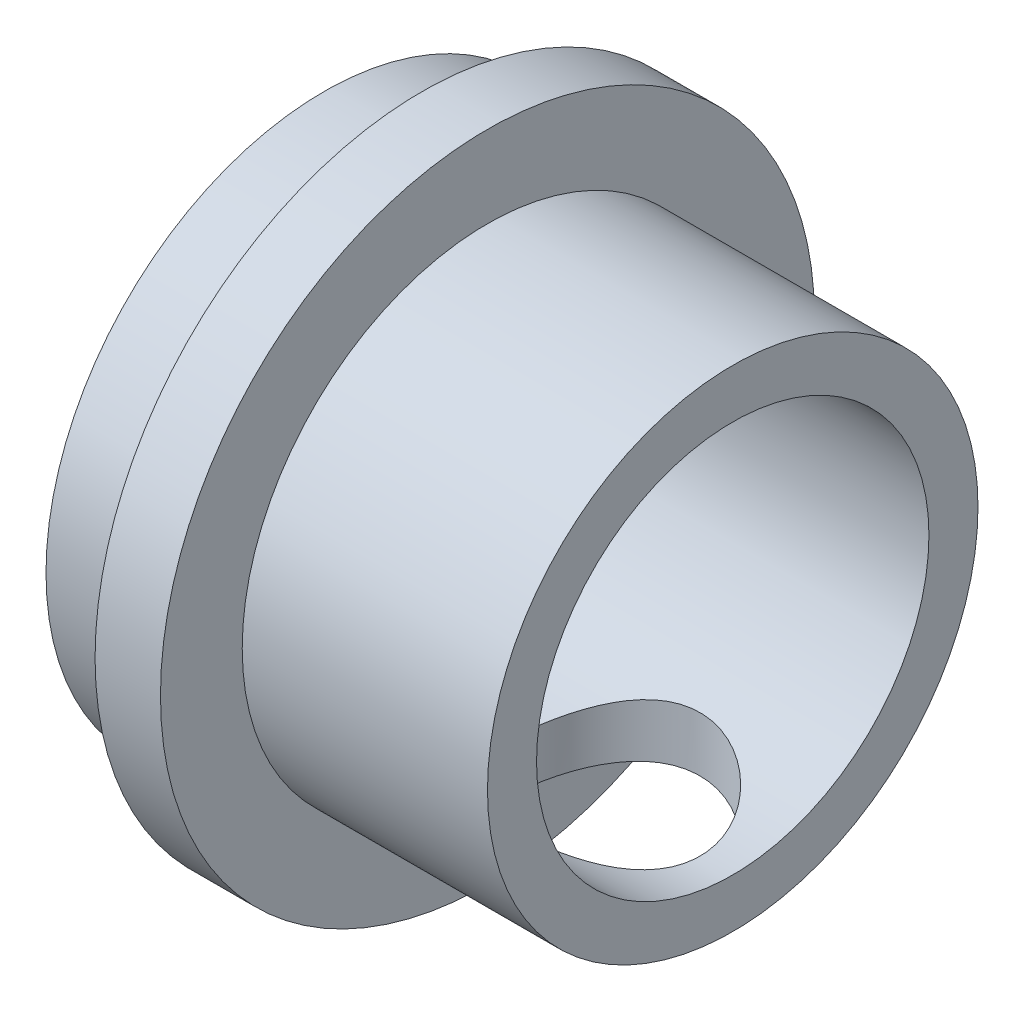
ISO-10303-21;
HEADER;
FILE_DESCRIPTION(('STEP AP214'),'2;1');
FILE_NAME('part.step','',(''),(''),'','','');
FILE_SCHEMA(('AUTOMOTIVE_DESIGN { 1 0 10303 214 1 1 1 1 }'));
ENDSEC;
DATA;
#1=APPLICATION_CONTEXT('core data for automotive mechanical design processes');
#2=APPLICATION_PROTOCOL_DEFINITION('international standard','automotive_design',2000,#1);
#3=PRODUCT_CONTEXT('',#1,'mechanical');
#4=PRODUCT('Part','Part','',(#3));
#5=PRODUCT_RELATED_PRODUCT_CATEGORY('part','',(#4));
#6=PRODUCT_DEFINITION_FORMATION('','',#4);
#7=PRODUCT_DEFINITION_CONTEXT('part definition',#1,'design');
#8=PRODUCT_DEFINITION('design','',#6,#7);
#9=PRODUCT_DEFINITION_SHAPE('','',#8);
#10=(LENGTH_UNIT() NAMED_UNIT(*) SI_UNIT(.MILLI.,.METRE.));
#11=(NAMED_UNIT(*) PLANE_ANGLE_UNIT() SI_UNIT($,.RADIAN.));
#12=(NAMED_UNIT(*) SI_UNIT($,.STERADIAN.) SOLID_ANGLE_UNIT());
#13=UNCERTAINTY_MEASURE_WITH_UNIT(LENGTH_MEASURE(1.E-05),#10,'distance_accuracy_value','');
#14=(GEOMETRIC_REPRESENTATION_CONTEXT(3) GLOBAL_UNCERTAINTY_ASSIGNED_CONTEXT((#13)) GLOBAL_UNIT_ASSIGNED_CONTEXT((#10,
#11,#12)) REPRESENTATION_CONTEXT('',''));
#15=CARTESIAN_POINT('',(0.,0.,0.));
#16=DIRECTION('',(0.,0.,1.));
#17=DIRECTION('',(1.,0.,0.));
#18=AXIS2_PLACEMENT_3D('',#15,#16,#17);
#19=CARTESIAN_POINT('',(12.5,4.,-4.));
#20=DIRECTION('',(0.,0.,-1.));
#21=DIRECTION('',(0.,1.,0.));
#22=AXIS2_PLACEMENT_3D('',#19,#20,#21);
#23=PLANE('',#22);
#24=DIRECTION('',(0.,-1.,0.));
#25=VECTOR('',#24,1.);
#26=CARTESIAN_POINT('',(2.5,4.,-4.));
#27=LINE('',#26,#25);
#28=CARTESIAN_POINT('',(2.5,4.,-4.));
#29=VERTEX_POINT('',#28);
#30=CARTESIAN_POINT('',(2.5,-4.,-4.));
#31=VERTEX_POINT('',#30);
#32=EDGE_CURVE('E54',#29,#31,#27,.T.);
#33=ORIENTED_EDGE('',*,*,#32,.F.);
#34=DIRECTION('',(-1.,0.,0.));
#35=VECTOR('',#34,1.);
#36=CARTESIAN_POINT('',(12.5,4.,-4.));
#37=LINE('',#36,#35);
#38=CARTESIAN_POINT('',(0.,4.,-4.));
#39=VERTEX_POINT('',#38);
#40=EDGE_CURVE('E97',#29,#39,#37,.T.);
#41=ORIENTED_EDGE('',*,*,#40,.T.);
#42=DIRECTION('',(0.,-1.,0.));
#43=VECTOR('',#42,1.);
#44=CARTESIAN_POINT('',(0.,4.,-4.));
#45=LINE('',#44,#43);
#46=CARTESIAN_POINT('',(0.,-4.,-4.));
#47=VERTEX_POINT('',#46);
#48=EDGE_CURVE('E198',#39,#47,#45,.T.);
#49=ORIENTED_EDGE('',*,*,#48,.T.);
#50=DIRECTION('',(-1.,0.,0.));
#51=VECTOR('',#50,1.);
#52=CARTESIAN_POINT('',(12.5,-4.,-4.));
#53=LINE('',#52,#51);
#54=EDGE_CURVE('E61',#31,#47,#53,.T.);
#55=ORIENTED_EDGE('',*,*,#54,.F.);
#56=EDGE_LOOP('',(#33,#41,#49,#55));
#57=FACE_BOUND('',#56,.T.);
#58=ADVANCED_FACE('F35',(#57),#23,.F.);
#59=CARTESIAN_POINT('',(12.5,4.,-4.));
#60=DIRECTION('',(0.,1.,0.));
#61=DIRECTION('',(0.,0.,1.));
#62=AXIS2_PLACEMENT_3D('',#59,#60,#61);
#63=PLANE('',#62);
#64=DIRECTION('',(0.,0.,-1.));
#65=VECTOR('',#64,1.);
#66=CARTESIAN_POINT('',(2.5,4.,-4.));
#67=LINE('',#66,#65);
#68=CARTESIAN_POINT('',(2.5,4.,4.));
#69=VERTEX_POINT('',#68);
#70=EDGE_CURVE('E89',#69,#29,#67,.T.);
#71=ORIENTED_EDGE('',*,*,#70,.F.);
#72=DIRECTION('',(-1.,0.,0.));
#73=VECTOR('',#72,1.);
#74=CARTESIAN_POINT('',(12.5,4.,4.));
#75=LINE('',#74,#73);
#76=CARTESIAN_POINT('',(0.,4.,4.));
#77=VERTEX_POINT('',#76);
#78=EDGE_CURVE('E88',#69,#77,#75,.T.);
#79=ORIENTED_EDGE('',*,*,#78,.T.);
#80=DIRECTION('',(0.,0.,-1.));
#81=VECTOR('',#80,1.);
#82=CARTESIAN_POINT('',(0.,4.,-4.));
#83=LINE('',#82,#81);
#84=EDGE_CURVE('E99',#77,#39,#83,.T.);
#85=ORIENTED_EDGE('',*,*,#84,.T.);
#86=ORIENTED_EDGE('',*,*,#40,.F.);
#87=EDGE_LOOP('',(#71,#79,#85,#86));
#88=FACE_BOUND('',#87,.T.);
#89=ADVANCED_FACE('F165',(#88),#63,.F.);
#90=CARTESIAN_POINT('',(12.5,4.,4.));
#91=DIRECTION('',(0.,0.,1.));
#92=DIRECTION('',(0.,-1.,0.));
#93=AXIS2_PLACEMENT_3D('',#90,#91,#92);
#94=PLANE('',#93);
#95=DIRECTION('',(0.,1.,0.));
#96=VECTOR('',#95,1.);
#97=CARTESIAN_POINT('',(2.5,4.,4.));
#98=LINE('',#97,#96);
#99=CARTESIAN_POINT('',(2.5,-4.,4.));
#100=VERTEX_POINT('',#99);
#101=EDGE_CURVE('E80',#100,#69,#98,.T.);
#102=ORIENTED_EDGE('',*,*,#101,.F.);
#103=DIRECTION('',(-1.,0.,0.));
#104=VECTOR('',#103,1.);
#105=CARTESIAN_POINT('',(12.5,-4.,4.));
#106=LINE('',#105,#104);
#107=CARTESIAN_POINT('',(0.,-4.,4.));
#108=VERTEX_POINT('',#107);
#109=EDGE_CURVE('E87',#100,#108,#106,.T.);
#110=ORIENTED_EDGE('',*,*,#109,.T.);
#111=DIRECTION('',(0.,1.,0.));
#112=VECTOR('',#111,1.);
#113=CARTESIAN_POINT('',(0.,4.,4.));
#114=LINE('',#113,#112);
#115=EDGE_CURVE('E201',#108,#77,#114,.T.);
#116=ORIENTED_EDGE('',*,*,#115,.T.);
#117=ORIENTED_EDGE('',*,*,#78,.F.);
#118=EDGE_LOOP('',(#102,#110,#116,#117));
#119=FACE_BOUND('',#118,.T.);
#120=ADVANCED_FACE('F85',(#119),#94,.F.);
#121=CARTESIAN_POINT('',(12.5,-4.,-4.));
#122=DIRECTION('',(0.,-1.,0.));
#123=DIRECTION('',(0.,0.,-1.));
#124=AXIS2_PLACEMENT_3D('',#121,#122,#123);
#125=PLANE('',#124);
#126=DIRECTION('',(0.,0.,1.));
#127=VECTOR('',#126,1.);
#128=CARTESIAN_POINT('',(2.5,-4.,-4.));
#129=LINE('',#128,#127);
#130=EDGE_CURVE('E11',#31,#100,#129,.T.);
#131=ORIENTED_EDGE('',*,*,#130,.F.);
#132=ORIENTED_EDGE('',*,*,#54,.T.);
#133=DIRECTION('',(0.,0.,1.));
#134=VECTOR('',#133,1.);
#135=CARTESIAN_POINT('',(0.,-4.,-4.));
#136=LINE('',#135,#134);
#137=EDGE_CURVE('E94',#47,#108,#136,.T.);
#138=ORIENTED_EDGE('',*,*,#137,.T.);
#139=ORIENTED_EDGE('',*,*,#109,.F.);
#140=EDGE_LOOP('',(#131,#132,#138,#139));
#141=FACE_BOUND('',#140,.T.);
#142=ADVANCED_FACE('F92',(#141),#125,.F.);
#143=CARTESIAN_POINT('',(0.,0.,0.));
#144=DIRECTION('',(1.,0.,0.));
#145=DIRECTION('',(0.,0.,-1.));
#146=AXIS2_PLACEMENT_3D('',#143,#144,#145);
#147=PLANE('',#146);
#148=ORIENTED_EDGE('',*,*,#137,.F.);
#149=ORIENTED_EDGE('',*,*,#48,.F.);
#150=ORIENTED_EDGE('',*,*,#84,.F.);
#151=ORIENTED_EDGE('',*,*,#115,.F.);
#152=EDGE_LOOP('',(#148,#149,#150,#151));
#153=FACE_BOUND('',#152,.T.);
#154=CARTESIAN_POINT('',(0.,0.,0.));
#155=DIRECTION('',(-1.,0.,0.));
#156=DIRECTION('',(0.,0.,1.));
#157=AXIS2_PLACEMENT_3D('',#154,#155,#156);
#158=CIRCLE('',#157,8.5);
#159=CARTESIAN_POINT('',(0.,0.,8.5));
#160=VERTEX_POINT('',#159);
#161=EDGE_CURVE('E48',#160,#160,#158,.T.);
#162=ORIENTED_EDGE('',*,*,#161,.T.);
#163=EDGE_LOOP('',(#162));
#164=FACE_BOUND('',#163,.T.);
#165=ADVANCED_FACE('F37',(#153,#164),#147,.F.);
#166=CARTESIAN_POINT('',(-59.6035396155649,0.,0.));
#167=DIRECTION('',(-1.,0.,0.));
#168=DIRECTION('',(0.,0.,1.));
#169=AXIS2_PLACEMENT_3D('',#166,#167,#168);
#170=CYLINDRICAL_SURFACE('',#169,8.5);
#171=ORIENTED_EDGE('',*,*,#161,.F.);
#172=EDGE_LOOP('',(#171));
#173=FACE_BOUND('',#172,.T.);
#174=CARTESIAN_POINT('',(3.,0.,0.));
#175=DIRECTION('',(-1.,0.,0.));
#176=DIRECTION('',(0.,0.,1.));
#177=AXIS2_PLACEMENT_3D('',#174,#175,#176);
#178=CIRCLE('',#177,8.5);
#179=CARTESIAN_POINT('',(3.,0.,8.5));
#180=VERTEX_POINT('',#179);
#181=EDGE_CURVE('E115',#180,#180,#178,.T.);
#182=ORIENTED_EDGE('',*,*,#181,.T.);
#183=EDGE_LOOP('',(#182));
#184=FACE_BOUND('',#183,.T.);
#185=ADVANCED_FACE('F122',(#173,#184),#170,.T.);
#186=CARTESIAN_POINT('',(3.,9.09366399233855,0.));
#187=DIRECTION('',(1.,0.,0.));
#188=DIRECTION('',(0.,0.,-1.));
#189=AXIS2_PLACEMENT_3D('',#186,#187,#188);
#190=PLANE('',#189);
#191=ORIENTED_EDGE('',*,*,#181,.F.);
#192=EDGE_LOOP('',(#191));
#193=FACE_BOUND('',#192,.T.);
#194=CARTESIAN_POINT('',(3.,0.,0.));
#195=DIRECTION('',(-1.,0.,0.));
#196=DIRECTION('',(0.,0.,1.));
#197=AXIS2_PLACEMENT_3D('',#194,#195,#196);
#198=CIRCLE('',#197,10.);
#199=CARTESIAN_POINT('',(3.,0.,10.));
#200=VERTEX_POINT('',#199);
#201=EDGE_CURVE('E112',#200,#200,#198,.T.);
#202=ORIENTED_EDGE('',*,*,#201,.T.);
#203=EDGE_LOOP('',(#202));
#204=FACE_BOUND('',#203,.T.);
#205=ADVANCED_FACE('F125',(#193,#204),#190,.F.);
#206=CARTESIAN_POINT('',(-59.6035396155649,0.,0.));
#207=DIRECTION('',(-1.,0.,0.));
#208=DIRECTION('',(0.,0.,1.));
#209=AXIS2_PLACEMENT_3D('',#206,#207,#208);
#210=CYLINDRICAL_SURFACE('',#209,10.);
#211=ORIENTED_EDGE('',*,*,#201,.F.);
#212=EDGE_LOOP('',(#211));
#213=FACE_BOUND('',#212,.T.);
#214=CARTESIAN_POINT('',(5.,0.,0.));
#215=DIRECTION('',(-1.,0.,0.));
#216=DIRECTION('',(0.,0.,1.));
#217=AXIS2_PLACEMENT_3D('',#214,#215,#216);
#218=CIRCLE('',#217,10.);
#219=CARTESIAN_POINT('',(5.,0.,10.));
#220=VERTEX_POINT('',#219);
#221=EDGE_CURVE('E109',#220,#220,#218,.T.);
#222=ORIENTED_EDGE('',*,*,#221,.T.);
#223=EDGE_LOOP('',(#222));
#224=FACE_BOUND('',#223,.T.);
#225=ADVANCED_FACE('F130',(#213,#224),#210,.T.);
#226=CARTESIAN_POINT('',(5.,10.,0.));
#227=DIRECTION('',(-1.,0.,0.));
#228=DIRECTION('',(0.,0.,1.));
#229=AXIS2_PLACEMENT_3D('',#226,#227,#228);
#230=PLANE('',#229);
#231=ORIENTED_EDGE('',*,*,#221,.F.);
#232=EDGE_LOOP('',(#231));
#233=FACE_BOUND('',#232,.T.);
#234=CARTESIAN_POINT('',(5.,0.,0.));
#235=DIRECTION('',(-1.,0.,0.));
#236=DIRECTION('',(0.,0.,1.));
#237=AXIS2_PLACEMENT_3D('',#234,#235,#236);
#238=CIRCLE('',#237,7.5);
#239=CARTESIAN_POINT('',(5.,0.,7.5));
#240=VERTEX_POINT('',#239);
#241=EDGE_CURVE('E106',#240,#240,#238,.T.);
#242=ORIENTED_EDGE('',*,*,#241,.T.);
#243=EDGE_LOOP('',(#242));
#244=FACE_BOUND('',#243,.T.);
#245=ADVANCED_FACE('F136',(#233,#244),#230,.F.);
#246=CARTESIAN_POINT('',(-59.6035396155649,0.,0.));
#247=DIRECTION('',(-1.,0.,0.));
#248=DIRECTION('',(0.,0.,1.));
#249=AXIS2_PLACEMENT_3D('',#246,#247,#248);
#250=CYLINDRICAL_SURFACE('',#249,7.5);
#251=CARTESIAN_POINT('',(8.5,-6.87386354243376,3.));
#252=CARTESIAN_POINT('',(8.66068553456943,-6.87387034169605,2.99999310102034));
#253=CARTESIAN_POINT('',(8.82163944149776,-6.87957650695683,2.9870126033011));
#254=CARTESIAN_POINT('',(9.13890862614936,-6.901666249599,2.93560066312235));
#255=CARTESIAN_POINT('',(9.29521098150777,-6.9180771094252,2.89710418548511));
#256=CARTESIAN_POINT('',(9.59807771345624,-6.95940616078833,2.79635331714323));
#257=CARTESIAN_POINT('',(9.74467636493683,-6.98429226391323,2.73418843497826));
#258=CARTESIAN_POINT('',(10.0253280322934,-7.0397201578331,2.58813019791228));
#259=CARTESIAN_POINT('',(10.1593837787862,-7.07026071330917,2.5042415873656));
#260=CARTESIAN_POINT('',(10.4188904718165,-7.13551292343503,2.31198302134881));
#261=CARTESIAN_POINT('',(10.5435345990959,-7.17035875533909,2.20256905254826));
#262=CARTESIAN_POINT('',(10.7732935312837,-7.23918686872916,1.96456364269823));
#263=CARTESIAN_POINT('',(10.8784015115646,-7.27316884487642,1.8359655281602));
#264=CARTESIAN_POINT('',(11.0701095854646,-7.33805111462092,1.55700947005954));
#265=CARTESIAN_POINT('',(11.1558164495289,-7.36877705418855,1.40599344962864));
#266=CARTESIAN_POINT('',(11.3002653552607,-7.42205891553774,1.09023798310296));
#267=CARTESIAN_POINT('',(11.3590183693733,-7.44461816104874,0.925504153615325));
#268=CARTESIAN_POINT('',(11.4450122289896,-7.47807487485913,0.595449640559631));
#269=CARTESIAN_POINT('',(11.4736409709553,-7.48948405155941,0.430543477287475));
#270=CARTESIAN_POINT('',(11.5030427286722,-7.50120466031146,0.0978994928759432));
#271=CARTESIAN_POINT('',(11.5038261339487,-7.50152023155834,-0.0698372487591169));
#272=CARTESIAN_POINT('',(11.4782758452937,-7.49132944230918,-0.393348742053133));
#273=CARTESIAN_POINT('',(11.4534628408679,-7.48142995157228,-0.549266179305685));
#274=CARTESIAN_POINT('',(11.3800106855455,-7.45273937203712,-0.85450966383287));
#275=CARTESIAN_POINT('',(11.3313697864023,-7.43394763082012,-1.00383522658686));
#276=CARTESIAN_POINT('',(11.2110452756826,-7.388952366862,-1.29434690776584));
#277=CARTESIAN_POINT('',(11.1390254277769,-7.36264140699335,-1.43537643506834));
#278=CARTESIAN_POINT('',(10.9743024896213,-7.30521877770412,-1.70371222611197));
#279=CARTESIAN_POINT('',(10.8815923103497,-7.27410546400724,-1.83101376407694));
#280=CARTESIAN_POINT('',(10.6710262960842,-7.20782455764183,-2.07715324198526));
#281=CARTESIAN_POINT('',(10.5519191611408,-7.17252489767638,-2.19488676789948));
#282=CARTESIAN_POINT('',(10.295514142252,-7.10342491459894,-2.40916112308897));
#283=CARTESIAN_POINT('',(10.1582103277066,-7.06962508512114,-2.50569501568047));
#284=CARTESIAN_POINT('',(9.86437146643909,-7.00645346113535,-2.67735628307891));
#285=CARTESIAN_POINT('',(9.70740275449202,-6.97723371086562,-2.75180197745439));
#286=CARTESIAN_POINT('',(9.38167676453166,-6.92831385516127,-2.87276438979969));
#287=CARTESIAN_POINT('',(9.21292722291011,-6.90860756836966,-2.91929924756697));
#288=CARTESIAN_POINT('',(8.87944633379884,-6.88244639554074,-2.98043242328234));
#289=CARTESIAN_POINT('',(8.71509932930716,-6.87525549684207,-2.99680814522181));
#290=CARTESIAN_POINT('',(8.38588418836066,-6.87284246803558,-3.00234198966433));
#291=CARTESIAN_POINT('',(8.22101622508652,-6.87761670840543,-2.99150836588692));
#292=CARTESIAN_POINT('',(7.90531159756458,-6.8978406653867,-2.94454934218505));
#293=CARTESIAN_POINT('',(7.75421059389991,-6.91266686697452,-2.90989959303579));
#294=CARTESIAN_POINT('',(7.46006739282182,-6.9505507654101,-2.8182062803663));
#295=CARTESIAN_POINT('',(7.31702699033927,-6.97361028732897,-2.76115775145341));
#296=CARTESIAN_POINT('',(7.03659646330651,-7.02650672790152,-2.62370345922236));
#297=CARTESIAN_POINT('',(6.8996707169582,-7.05658056958766,-2.54244430239697));
#298=CARTESIAN_POINT('',(6.64077551883762,-7.11975577736692,-2.35974783666273));
#299=CARTESIAN_POINT('',(6.51881219080683,-7.15285837344067,-2.25830231022284));
#300=CARTESIAN_POINT('',(6.28393988710094,-7.22131373957124,-2.02926631752087));
#301=CARTESIAN_POINT('',(6.1723651520626,-7.2566521092785,-1.90029814416815));
#302=CARTESIAN_POINT('',(5.97223438508534,-7.32329691851298,-1.62462545005276));
#303=CARTESIAN_POINT('',(5.88367929010732,-7.35460319389703,-1.47792020769991));
#304=CARTESIAN_POINT('',(5.73242856030499,-7.40975573850584,-1.17041990100452));
#305=CARTESIAN_POINT('',(5.6697267337395,-7.4336037936099,-1.00962822149812));
#306=CARTESIAN_POINT('',(5.57267672140036,-7.47109070203356,-0.678590386371821));
#307=CARTESIAN_POINT('',(5.53831314788396,-7.48473509559155,-0.508349415415229));
#308=CARTESIAN_POINT('',(5.50074294752073,-7.49968512317787,-0.175224765543923));
#309=CARTESIAN_POINT('',(5.49564980715696,-7.50173770124618,-0.0125857389781309));
#310=CARTESIAN_POINT('',(5.5117832190752,-7.49529063560582,0.311150753688397));
#311=CARTESIAN_POINT('',(5.53300578723337,-7.48679258923161,0.472248449421579));
#312=CARTESIAN_POINT('',(5.59982018199982,-7.46057270072754,0.783256352600095));
#313=CARTESIAN_POINT('',(5.64464341713483,-7.44314221048496,0.933358205797302));
#314=CARTESIAN_POINT('',(5.7565792088216,-7.40092421651037,1.2238835333139));
#315=CARTESIAN_POINT('',(5.82369587640864,-7.37613535594288,1.36430521678368));
#316=CARTESIAN_POINT('',(5.98165479002985,-7.320271419178,1.63830455820773));
#317=CARTESIAN_POINT('',(6.0734144129877,-7.288966960308,1.77130556278107));
#318=CARTESIAN_POINT('',(6.27668280812049,-7.2238410334062,2.0205810602219));
#319=CARTESIAN_POINT('',(6.38819975441232,-7.19001852696379,2.13684859379602));
#320=CARTESIAN_POINT('',(6.63597272027298,-7.1210665105152,2.35680182841674));
#321=CARTESIAN_POINT('',(6.77333286271614,-7.08598570842144,2.45926306504163));
#322=CARTESIAN_POINT('',(7.06441365358124,-7.02074485276124,2.63977144144724));
#323=CARTESIAN_POINT('',(7.21813622268031,-6.99058537793172,2.71781571083651));
#324=CARTESIAN_POINT('',(7.52355427970529,-6.94138371358595,2.84098572677451));
#325=CARTESIAN_POINT('',(7.67419240406866,-6.92158645020622,2.88843803497901));
#326=CARTESIAN_POINT('',(7.98173356223896,-6.8916873905118,2.95907986392734));
#327=CARTESIAN_POINT('',(8.13861786013653,-6.88155858435653,2.98233699287411));
#328=CARTESIAN_POINT('',(8.33016735866728,-6.87587645913135,2.99538303278269));
#329=CARTESIAN_POINT('',(8.36410222053464,-6.87512296675926,2.99711296127843));
#330=CARTESIAN_POINT('',(8.43202071519583,-6.87411577084084,2.99942221686375));
#331=CARTESIAN_POINT('',(8.46600435138273,-6.8738621039388,3.0000014595918));
#332=CARTESIAN_POINT('',(8.5,-6.87386354243376,3.));
#333=B_SPLINE_CURVE_WITH_KNOTS('',3,(#251,#252,#253,#254,#255,#256,#257,#258,#259,#260,#261,
#262,#263,#264,#265,#266,#267,#268,#269,#270,#271,#272,#273,#274,#275,#276,#277,#278,#279,#280,
#281,#282,#283,#284,#285,#286,#287,#288,#289,#290,#291,#292,#293,#294,#295,#296,#297,#298,#299,
#300,#301,#302,#303,#304,#305,#306,#307,#308,#309,#310,#311,#312,#313,#314,#315,#316,#317,#318,
#319,#320,#321,#322,#323,#324,#325,#326,#327,#328,#329,#330,#331,#332),.UNSPECIFIED.,.T.,.F.,(4,
2,2,2,2,2,2,2,2,2,2,2,2,2,2,2,2,2,2,2,2,2,2,2,2,2,2,2,2,2,2,2,2,2,2,2,2,2,2,2,4),(0.,
0.481916473151481,0.965066003733368,1.44640623494009,1.92764143235792,2.43383427426637,
2.94020361522513,3.46654003637142,3.9926620045422,4.49331274330775,4.99377667958508,
5.46612967245453,5.93851732693589,6.41802450352347,6.89769622410047,7.40886066122033,
7.9201921069069,8.44596688075886,8.97139957200152,9.4647322128663,9.95791522361909,
10.4230087212772,10.8882053797746,11.3722673197905,11.8565267178877,12.3765560137047,
12.8966064727912,13.4165323096922,13.936175639312,14.4219155963393,14.907582022689,
15.3783299166503,15.8491646674288,16.3408057670989,16.8326507484631,17.3549437992842,
17.8772982263878,18.3527499122861,18.8268694532887,18.928819278144,19.0307765770883),.UNSPECIFIED.);
#334=CARTESIAN_POINT('',(8.5,-6.87386354243376,3.));
#335=VERTEX_POINT('',#334);
#336=EDGE_CURVE('E185',#335,#335,#333,.T.);
#337=ORIENTED_EDGE('',*,*,#336,.T.);
#338=EDGE_LOOP('',(#337));
#339=FACE_BOUND('',#338,.T.);
#340=ORIENTED_EDGE('',*,*,#241,.F.);
#341=EDGE_LOOP('',(#340));
#342=FACE_BOUND('',#341,.T.);
#343=CARTESIAN_POINT('',(12.5,0.,0.));
#344=DIRECTION('',(-1.,0.,0.));
#345=DIRECTION('',(0.,0.,1.));
#346=AXIS2_PLACEMENT_3D('',#343,#344,#345);
#347=CIRCLE('',#346,7.5);
#348=CARTESIAN_POINT('',(12.5,0.,7.5));
#349=VERTEX_POINT('',#348);
#350=EDGE_CURVE('E103',#349,#349,#347,.T.);
#351=ORIENTED_EDGE('',*,*,#350,.T.);
#352=EDGE_LOOP('',(#351));
#353=FACE_BOUND('',#352,.T.);
#354=ADVANCED_FACE('F142',(#339,#342,#353),#250,.T.);
#355=CARTESIAN_POINT('',(12.5,7.5,0.));
#356=DIRECTION('',(-1.,0.,0.));
#357=DIRECTION('',(0.,0.,1.));
#358=AXIS2_PLACEMENT_3D('',#355,#356,#357);
#359=PLANE('',#358);
#360=CARTESIAN_POINT('',(12.5,0.,0.));
#361=DIRECTION('',(1.,0.,0.));
#362=DIRECTION('',(0.,0.,-1.));
#363=AXIS2_PLACEMENT_3D('',#360,#361,#362);
#364=CIRCLE('',#363,6.);
#365=CARTESIAN_POINT('',(12.5,0.,-6.));
#366=VERTEX_POINT('',#365);
#367=EDGE_CURVE('E190',#366,#366,#364,.T.);
#368=ORIENTED_EDGE('',*,*,#367,.F.);
#369=EDGE_LOOP('',(#368));
#370=FACE_BOUND('',#369,.T.);
#371=ORIENTED_EDGE('',*,*,#350,.F.);
#372=EDGE_LOOP('',(#371));
#373=FACE_BOUND('',#372,.T.);
#374=ADVANCED_FACE('F148',(#370,#373),#359,.F.);
#375=CARTESIAN_POINT('',(2.5,0.,0.));
#376=DIRECTION('',(1.,0.,0.));
#377=DIRECTION('',(0.,0.,-1.));
#378=AXIS2_PLACEMENT_3D('',#375,#376,#377);
#379=PLANE('',#378);
#380=CARTESIAN_POINT('',(2.5,0.,0.));
#381=DIRECTION('',(1.,0.,0.));
#382=DIRECTION('',(0.,0.,-1.));
#383=AXIS2_PLACEMENT_3D('',#380,#381,#382);
#384=CIRCLE('',#383,6.);
#385=CARTESIAN_POINT('',(2.5,0.,-6.));
#386=VERTEX_POINT('',#385);
#387=EDGE_CURVE('E90',#386,#386,#384,.T.);
#388=ORIENTED_EDGE('',*,*,#387,.T.);
#389=EDGE_LOOP('',(#388));
#390=FACE_BOUND('',#389,.T.);
#391=ORIENTED_EDGE('',*,*,#32,.T.);
#392=ORIENTED_EDGE('',*,*,#130,.T.);
#393=ORIENTED_EDGE('',*,*,#101,.T.);
#394=ORIENTED_EDGE('',*,*,#70,.T.);
#395=EDGE_LOOP('',(#391,#392,#393,#394));
#396=FACE_BOUND('',#395,.T.);
#397=ADVANCED_FACE('F79',(#390,#396),#379,.T.);
#398=CARTESIAN_POINT('',(2.5,0.,0.));
#399=DIRECTION('',(1.,0.,0.));
#400=DIRECTION('',(0.,0.,-1.));
#401=AXIS2_PLACEMENT_3D('',#398,#399,#400);
#402=CYLINDRICAL_SURFACE('',#401,6.);
#403=CARTESIAN_POINT('',(8.5,-5.19615242270663,3.));
#404=CARTESIAN_POINT('',(8.4217997667409,-5.19615338151414,2.99999910875738));
#405=CARTESIAN_POINT('',(8.34359000153542,-5.19792581191127,2.99693611207795));
#406=CARTESIAN_POINT('',(8.18779192485794,-5.20493931657123,2.98473565374509));
#407=CARTESIAN_POINT('',(8.1102039197315,-5.21018200566082,2.97559536411629));
#408=CARTESIAN_POINT('',(7.87905598575357,-5.23088200558207,2.9391691225804));
#409=CARTESIAN_POINT('',(7.72724908946674,-5.25131076607215,2.902878058149));
#410=CARTESIAN_POINT('',(7.43360836647645,-5.3024774692754,2.80829998089522));
#411=CARTESIAN_POINT('',(7.2917261982491,-5.33316051577918,2.75012989346617));
#412=CARTESIAN_POINT('',(7.01973723829918,-5.40128072966972,2.61380253964662));
#413=CARTESIAN_POINT('',(6.88963108412508,-5.43871826241347,2.53564419197538));
#414=CARTESIAN_POINT('',(6.63307985385227,-5.51990583559838,2.35399963256537));
#415=CARTESIAN_POINT('',(6.50782179784407,-5.56392184571631,2.24895611137363));
#416=CARTESIAN_POINT('',(6.27577563031045,-5.651159547025,2.01976141989962));
#417=CARTESIAN_POINT('',(6.1689967317433,-5.69438083245621,1.89560077655245));
#418=CARTESIAN_POINT('',(5.96989831226766,-5.77864428988887,1.62146869109162));
#419=CARTESIAN_POINT('',(5.87903863407277,-5.81934318752246,1.47032156718994));
#420=CARTESIAN_POINT('',(5.72457750257192,-5.89052268800541,1.15247107964639));
#421=CARTESIAN_POINT('',(5.66095884675342,-5.92100973690811,0.985777614653093));
#422=CARTESIAN_POINT('',(5.56748600201082,-5.96641383603058,0.654134831556286));
#423=CARTESIAN_POINT('',(5.53555142035194,-5.98228440595573,0.489905370480169));
#424=CARTESIAN_POINT('',(5.49950164455599,-6.00022751605263,0.157711887079234));
#425=CARTESIAN_POINT('',(5.49536961786774,-6.00230840492439,-0.010249813811035));
#426=CARTESIAN_POINT('',(5.51424003263481,-5.9928894562274,-0.329497576667918));
#427=CARTESIAN_POINT('',(5.53491408807804,-5.98255487247966,-0.480963609704587));
#428=CARTESIAN_POINT('',(5.59864249019648,-5.9512273620779,-0.777941303579839));
#429=CARTESIAN_POINT('',(5.64169851157788,-5.93023363786808,-0.923452517976628));
#430=CARTESIAN_POINT('',(5.74924785576957,-5.87914748253372,-1.20692822064062));
#431=CARTESIAN_POINT('',(5.81402953120064,-5.8489331854518,-1.34476044303001));
#432=CARTESIAN_POINT('',(5.96278965670795,-5.78212944004645,-1.60793023199368));
#433=CARTESIAN_POINT('',(6.04677497950966,-5.74553771044373,-1.73326330217191));
#434=CARTESIAN_POINT('',(6.24068847393953,-5.66533158492102,-1.98052168794677));
#435=CARTESIAN_POINT('',(6.35231851064165,-5.62138031742825,-2.10100497271934));
#436=CARTESIAN_POINT('',(6.59375974190886,-5.53363118085844,-2.32231036115798));
#437=CARTESIAN_POINT('',(6.72358479389567,-5.48983345502613,-2.42311733790258));
#438=CARTESIAN_POINT('',(7.00798214334072,-5.40432084665524,-2.6085269546345));
#439=CARTESIAN_POINT('',(7.16360243564598,-5.36291485750667,-2.691694028528));
#440=CARTESIAN_POINT('',(7.40756305461175,-5.30915194408667,-2.79542837524198));
#441=CARTESIAN_POINT('',(7.49065631040476,-5.2926194649543,-2.82650797342001));
#442=CARTESIAN_POINT('',(7.65980860303443,-5.26298473463269,-2.88131297532033));
#443=CARTESIAN_POINT('',(7.74586577447478,-5.24988036897854,-2.90504291399185));
#444=CARTESIAN_POINT('',(7.91337162022402,-5.22855455988393,-2.94323927983803));
#445=CARTESIAN_POINT('',(7.99464942563784,-5.22002982263214,-2.95828810706486));
#446=CARTESIAN_POINT('',(8.15843523866589,-5.20672737157291,-2.98163903200842));
#447=CARTESIAN_POINT('',(8.24094258374831,-5.20194770920409,-2.98994463830254));
#448=CARTESIAN_POINT('',(8.4064710068027,-5.19633662863608,-2.99968663811345));
#449=CARTESIAN_POINT('',(8.48949188194369,-5.19550374026212,-3.00112558946313));
#450=CARTESIAN_POINT('',(8.65528646076465,-5.19780953199967,-2.99712742537402));
#451=CARTESIAN_POINT('',(8.73806018075052,-5.20094794403249,-2.99169077406596));
#452=CARTESIAN_POINT('',(8.96685913604269,-5.21504493010248,-2.96710135231213));
#453=CARTESIAN_POINT('',(9.11191081026327,-5.23019160660498,-2.9405616310018));
#454=CARTESIAN_POINT('',(9.39513091079686,-5.27081666384497,-2.86709067362229));
#455=CARTESIAN_POINT('',(9.53329709183022,-5.29629839028765,-2.82015283383764));
#456=CARTESIAN_POINT('',(9.80622610391992,-5.35608780273032,-2.70494224478443));
#457=CARTESIAN_POINT('',(9.94053492790409,-5.3907496041273,-2.63578205088436));
#458=CARTESIAN_POINT('',(10.196409938366,-5.46468327792416,-2.47886133231338));
#459=CARTESIAN_POINT('',(10.3179695308115,-5.50395751387985,-2.39109125263821));
#460=CARTESIAN_POINT('',(10.5609356266319,-5.58864005140301,-2.18651145695799));
#461=CARTESIAN_POINT('',(10.6803912709,-5.63419752084738,-2.067435804994));
#462=CARTESIAN_POINT('',(10.8982368952948,-5.72202702310923,-1.8102134981498));
#463=CARTESIAN_POINT('',(10.9966197596755,-5.76429794308225,-1.67206042712515));
#464=CARTESIAN_POINT('',(11.1717211275736,-5.84224085806642,-1.37560608443379));
#465=CARTESIAN_POINT('',(11.2477993418831,-5.87770925226883,-1.21686929217555));
#466=CARTESIAN_POINT('',(11.3714137243106,-5.93650064667294,-0.88656709446955));
#467=CARTESIAN_POINT('',(11.418974954842,-5.95983430919533,-0.715013103124009));
#468=CARTESIAN_POINT('',(11.4801056918491,-5.9900252464518,-0.380939047947199));
#469=CARTESIAN_POINT('',(11.4963936355608,-5.99819783930701,-0.219034335650393));
#470=CARTESIAN_POINT('',(11.5025297884335,-6.00126390919338,0.105377961951197));
#471=CARTESIAN_POINT('',(11.4923872531832,-5.99616203476054,0.267885316317458));
#472=CARTESIAN_POINT('',(11.4477508098665,-5.97401907190636,0.577613962536139));
#473=CARTESIAN_POINT('',(11.4149055623343,-5.95778686442443,0.725136901247722));
#474=CARTESIAN_POINT('',(11.3280188919679,-5.91576278551446,1.01233790874441));
#475=CARTESIAN_POINT('',(11.2739744294575,-5.88996954319457,1.15201484923628));
#476=CARTESIAN_POINT('',(11.1438192713113,-5.829778017116,1.42627001605163));
#477=CARTESIAN_POINT('',(11.0668636584637,-5.79505887623287,1.56037465678411));
#478=CARTESIAN_POINT('',(10.8941245785864,-5.7206436338201,1.81432469711303));
#479=CARTESIAN_POINT('',(10.7983324640113,-5.68094524943991,1.93416350676913));
#480=CARTESIAN_POINT('',(10.5796152775165,-5.59585978819439,2.16873884087782));
#481=CARTESIAN_POINT('',(10.4549386792264,-5.55029975504518,2.28178066887875));
#482=CARTESIAN_POINT('',(10.1876216719299,-5.46188649509677,2.48600225783028));
#483=CARTESIAN_POINT('',(10.0449655389689,-5.41903568750872,2.57716267726705));
#484=CARTESIAN_POINT('',(9.81746820669822,-5.36004774906988,2.69665559342489));
#485=CARTESIAN_POINT('',(9.73802419901758,-5.34101219148464,2.73405408762355));
#486=CARTESIAN_POINT('',(9.57564671699128,-5.30572783063718,2.80191257626505));
#487=CARTESIAN_POINT('',(9.49271506625199,-5.28947759301443,2.83237614466584));
#488=CARTESIAN_POINT('',(9.32415526763024,-5.26045215868186,2.88592624586958));
#489=CARTESIAN_POINT('',(9.23853469275864,-5.24766803509091,2.90903175649394));
#490=CARTESIAN_POINT('',(9.06514474468574,-5.22608869625113,2.9476242805163));
#491=CARTESIAN_POINT('',(8.97737691907938,-5.21729069243665,2.96311662049621));
#492=CARTESIAN_POINT('',(8.82460118224006,-5.20588528016134,2.9830938122572));
#493=CARTESIAN_POINT('',(8.75990519109301,-5.20224442588138,2.9894274622838));
#494=CARTESIAN_POINT('',(8.63014168320032,-5.19737751744686,2.99788106792142));
#495=CARTESIAN_POINT('',(8.56507414189239,-5.1961516248372,3.00000074164547));
#496=CARTESIAN_POINT('',(8.5,-5.19615242270663,3.));
#497=B_SPLINE_CURVE_WITH_KNOTS('',3,(#403,#404,#405,#406,#407,#408,#409,#410,#411,#412,#413,
#414,#415,#416,#417,#418,#419,#420,#421,#422,#423,#424,#425,#426,#427,#428,#429,#430,#431,#432,
#433,#434,#435,#436,#437,#438,#439,#440,#441,#442,#443,#444,#445,#446,#447,#448,#449,#450,#451,
#452,#453,#454,#455,#456,#457,#458,#459,#460,#461,#462,#463,#464,#465,#466,#467,#468,#469,#470,
#471,#472,#473,#474,#475,#476,#477,#478,#479,#480,#481,#482,#483,#484,#485,#486,#487,#488,#489,
#490,#491,#492,#493,#494,#495,#496),.UNSPECIFIED.,.T.,.F.,(4,2,2,2,2,2,2,2,2,2,2,2,2,2,2,2,2,2,
2,2,2,2,2,2,2,2,2,2,2,2,2,2,2,2,2,2,2,2,2,2,2,2,2,2,2,2,4),(0.,0.234529430733892,
0.469168072604262,0.93885038329453,1.40605749261242,1.87328988121656,2.37905864237582,
2.88507883741224,3.42520847204402,3.96499651379784,4.46637625391917,4.96745241546231,
5.42495462941726,5.88249108040477,6.34635774681551,6.81039068538927,7.31828744858783,
7.82657315225867,8.36713695676456,8.63752916119813,8.90775419202327,9.15669600787592,
9.40550821320573,9.65422772860785,9.90293045534218,10.3454331624118,10.7880792327729,
11.2512265518736,11.7146122462924,12.2364099671094,12.7583836090371,13.29413310208,
13.8294110539541,14.3155757713756,14.8015702635101,15.2555404058358,15.7095756650514,
16.1830301812752,16.6567025627126,17.177514915193,17.6987859450456,17.9680115893229,
18.2370981707631,18.5054849980179,18.7736837791728,18.9688338446807,19.1639969639894),.UNSPECIFIED.);
#498=CARTESIAN_POINT('',(8.5,-5.19615242270663,3.));
#499=VERTEX_POINT('',#498);
#500=EDGE_CURVE('E39',#499,#499,#497,.T.);
#501=ORIENTED_EDGE('',*,*,#500,.T.);
#502=EDGE_LOOP('',(#501));
#503=FACE_BOUND('',#502,.T.);
#504=ORIENTED_EDGE('',*,*,#387,.F.);
#505=EDGE_LOOP('',(#504));
#506=FACE_BOUND('',#505,.T.);
#507=ORIENTED_EDGE('',*,*,#367,.T.);
#508=EDGE_LOOP('',(#507));
#509=FACE_BOUND('',#508,.T.);
#510=ADVANCED_FACE('F159',(#503,#506,#509),#402,.F.);
#511=CARTESIAN_POINT('',(8.5,-10.,0.));
#512=DIRECTION('',(0.,1.,0.));
#513=DIRECTION('',(0.,0.,1.));
#514=AXIS2_PLACEMENT_3D('',#511,#512,#513);
#515=CYLINDRICAL_SURFACE('',#514,3.);
#516=ORIENTED_EDGE('',*,*,#500,.F.);
#517=EDGE_LOOP('',(#516));
#518=FACE_BOUND('',#517,.T.);
#519=ORIENTED_EDGE('',*,*,#336,.F.);
#520=EDGE_LOOP('',(#519));
#521=FACE_BOUND('',#520,.T.);
#522=ADVANCED_FACE('F178',(#518,#521),#515,.F.);
#523=CLOSED_SHELL('',(#58,#89,#120,#142,#165,#185,#205,#225,#245,#354,#374,#397,#510,#522));
#524=MANIFOLD_SOLID_BREP('B2',#523);
#525=ADVANCED_BREP_SHAPE_REPRESENTATION('',(#18,#524),#14);
#526=SHAPE_DEFINITION_REPRESENTATION(#9,#525);
ENDSEC;
END-ISO-10303-21;
